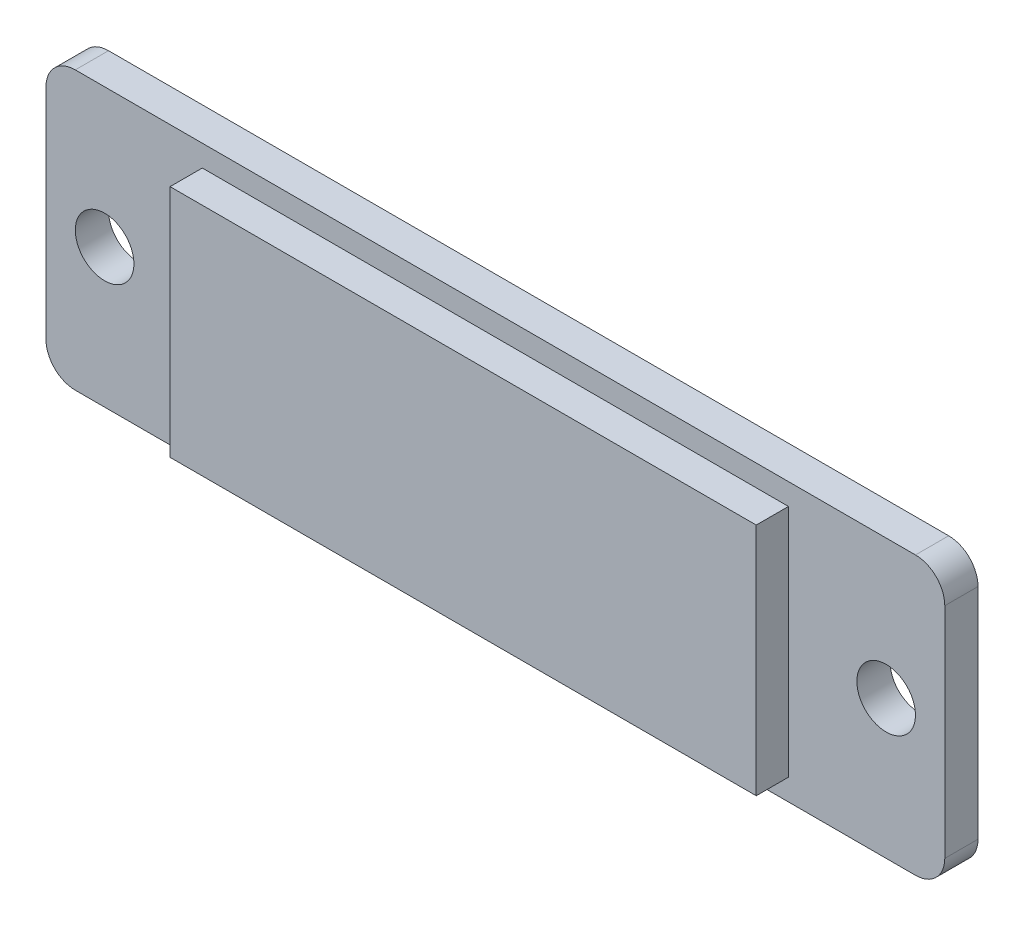
ISO-10303-21;
HEADER;
FILE_DESCRIPTION(('STEP AP214'),'2;1');
FILE_NAME('part.step','',(''),(''),'','','');
FILE_SCHEMA(('AUTOMOTIVE_DESIGN { 1 0 10303 214 1 1 1 1 }'));
ENDSEC;
DATA;
#1=APPLICATION_CONTEXT('core data for automotive mechanical design processes');
#2=APPLICATION_PROTOCOL_DEFINITION('international standard','automotive_design',2000,#1);
#3=PRODUCT_CONTEXT('',#1,'mechanical');
#4=PRODUCT('Part','Part','',(#3));
#5=PRODUCT_RELATED_PRODUCT_CATEGORY('part','',(#4));
#6=PRODUCT_DEFINITION_FORMATION('','',#4);
#7=PRODUCT_DEFINITION_CONTEXT('part definition',#1,'design');
#8=PRODUCT_DEFINITION('design','',#6,#7);
#9=PRODUCT_DEFINITION_SHAPE('','',#8);
#10=(LENGTH_UNIT() NAMED_UNIT(*) SI_UNIT(.MILLI.,.METRE.));
#11=(NAMED_UNIT(*) PLANE_ANGLE_UNIT() SI_UNIT($,.RADIAN.));
#12=(NAMED_UNIT(*) SI_UNIT($,.STERADIAN.) SOLID_ANGLE_UNIT());
#13=UNCERTAINTY_MEASURE_WITH_UNIT(LENGTH_MEASURE(1.E-05),#10,'distance_accuracy_value','');
#14=(GEOMETRIC_REPRESENTATION_CONTEXT(3) GLOBAL_UNCERTAINTY_ASSIGNED_CONTEXT((#13)) GLOBAL_UNIT_ASSIGNED_CONTEXT((#10,
#11,#12)) REPRESENTATION_CONTEXT('',''));
#15=CARTESIAN_POINT('',(0.,0.,0.));
#16=DIRECTION('',(0.,0.,1.));
#17=DIRECTION('',(1.,0.,0.));
#18=AXIS2_PLACEMENT_3D('',#15,#16,#17);
#19=CARTESIAN_POINT('',(-0.47863691545337,0.573934953021328,0.));
#20=DIRECTION('',(0.,0.,-1.));
#21=DIRECTION('',(0.,-1.,0.));
#22=AXIS2_PLACEMENT_3D('',#19,#20,#21);
#23=PLANE('',#22);
#24=CARTESIAN_POINT('',(-20.4786369154534,0.573934953021329,0.));
#25=DIRECTION('',(0.,0.,1.));
#26=DIRECTION('',(1.,0.,0.));
#27=AXIS2_PLACEMENT_3D('',#24,#25,#26);
#28=CIRCLE('',#27,1.5);
#29=CARTESIAN_POINT('',(-21.9786369154534,0.573934953021329,0.));
#30=VERTEX_POINT('',#29);
#31=EDGE_CURVE('E262',#30,#30,#28,.T.);
#32=ORIENTED_EDGE('',*,*,#31,.F.);
#33=EDGE_LOOP('',(#32));
#34=FACE_BOUND('',#33,.T.);
#35=CARTESIAN_POINT('',(19.5213630845466,0.573934953021329,0.));
#36=DIRECTION('',(0.,0.,1.));
#37=DIRECTION('',(1.,0.,0.));
#38=AXIS2_PLACEMENT_3D('',#35,#36,#37);
#39=CIRCLE('',#38,1.5);
#40=CARTESIAN_POINT('',(18.0213630845466,0.573934953021329,0.));
#41=VERTEX_POINT('',#40);
#42=EDGE_CURVE('E243',#41,#41,#39,.T.);
#43=ORIENTED_EDGE('',*,*,#42,.F.);
#44=EDGE_LOOP('',(#43));
#45=FACE_BOUND('',#44,.T.);
#46=DIRECTION('',(1.,0.,0.));
#47=VECTOR('',#46,1.);
#48=CARTESIAN_POINT('',(7.0213630845468,6.57393495302133,0.));
#49=LINE('',#48,#47);
#50=CARTESIAN_POINT('',(-15.4786369154534,6.57393495302133,0.));
#51=VERTEX_POINT('',#50);
#52=CARTESIAN_POINT('',(14.521363084547,6.57393495302133,0.));
#53=VERTEX_POINT('',#52);
#54=EDGE_CURVE('E162',#51,#53,#49,.T.);
#55=ORIENTED_EDGE('',*,*,#54,.T.);
#56=DIRECTION('',(0.,-1.,0.));
#57=VECTOR('',#56,1.);
#58=CARTESIAN_POINT('',(14.521363084547,-2.42606504697867,0.));
#59=LINE('',#58,#57);
#60=CARTESIAN_POINT('',(14.521363084547,-5.42606504697867,0.));
#61=VERTEX_POINT('',#60);
#62=EDGE_CURVE('E218',#53,#61,#59,.T.);
#63=ORIENTED_EDGE('',*,*,#62,.T.);
#64=DIRECTION('',(-1.,0.,0.));
#65=VECTOR('',#64,1.);
#66=CARTESIAN_POINT('',(-7.97863691545337,-5.42606504697867,0.));
#67=LINE('',#66,#65);
#68=CARTESIAN_POINT('',(-15.4786369154534,-5.42606504697867,0.));
#69=VERTEX_POINT('',#68);
#70=EDGE_CURVE('E67',#61,#69,#67,.T.);
#71=ORIENTED_EDGE('',*,*,#70,.T.);
#72=DIRECTION('',(0.,1.,0.));
#73=VECTOR('',#72,1.);
#74=CARTESIAN_POINT('',(-15.4786369154534,3.57393495302133,0.));
#75=LINE('',#74,#73);
#76=EDGE_CURVE('E151',#69,#51,#75,.T.);
#77=ORIENTED_EDGE('',*,*,#76,.T.);
#78=EDGE_LOOP('',(#55,#63,#71,#77));
#79=FACE_BOUND('',#78,.T.);
#80=DIRECTION('',(0.,-1.,0.));
#81=VECTOR('',#80,1.);
#82=CARTESIAN_POINT('',(22.5213630845466,0.573934953021329,0.));
#83=LINE('',#82,#81);
#84=CARTESIAN_POINT('',(22.5213630845466,6.17393495302133,0.));
#85=VERTEX_POINT('',#84);
#86=CARTESIAN_POINT('',(22.5213630845466,-5.02606504697867,0.));
#87=VERTEX_POINT('',#86);
#88=EDGE_CURVE('E27',#85,#87,#83,.T.);
#89=ORIENTED_EDGE('',*,*,#88,.F.);
#90=CARTESIAN_POINT('',(21.0213630845466,6.17393495302133,0.));
#91=DIRECTION('',(0.,0.,-1.));
#92=DIRECTION('',(0.,1.,0.));
#93=AXIS2_PLACEMENT_3D('',#90,#91,#92);
#94=CIRCLE('',#93,1.5);
#95=CARTESIAN_POINT('',(21.0213630845466,7.67393495302133,0.));
#96=VERTEX_POINT('',#95);
#97=EDGE_CURVE('E245',#96,#85,#94,.T.);
#98=ORIENTED_EDGE('',*,*,#97,.F.);
#99=DIRECTION('',(1.,0.,0.));
#100=VECTOR('',#99,1.);
#101=CARTESIAN_POINT('',(-21.9786369154534,7.67393495302133,0.));
#102=LINE('',#101,#100);
#103=CARTESIAN_POINT('',(-21.9786369154534,7.67393495302133,0.));
#104=VERTEX_POINT('',#103);
#105=EDGE_CURVE('E201',#104,#96,#102,.T.);
#106=ORIENTED_EDGE('',*,*,#105,.F.);
#107=CARTESIAN_POINT('',(-21.9786369154534,6.17393495302133,0.));
#108=DIRECTION('',(0.,0.,-1.));
#109=DIRECTION('',(-1.,0.,0.));
#110=AXIS2_PLACEMENT_3D('',#107,#108,#109);
#111=CIRCLE('',#110,1.5);
#112=CARTESIAN_POINT('',(-23.4786369154534,6.17393495302133,0.));
#113=VERTEX_POINT('',#112);
#114=EDGE_CURVE('E199',#113,#104,#111,.T.);
#115=ORIENTED_EDGE('',*,*,#114,.F.);
#116=DIRECTION('',(0.,-1.,0.));
#117=VECTOR('',#116,1.);
#118=CARTESIAN_POINT('',(-23.4786369154534,0.573934953021329,0.));
#119=LINE('',#118,#117);
#120=CARTESIAN_POINT('',(-23.4786369154534,-5.02606504697867,0.));
#121=VERTEX_POINT('',#120);
#122=EDGE_CURVE('E193',#113,#121,#119,.T.);
#123=ORIENTED_EDGE('',*,*,#122,.T.);
#124=CARTESIAN_POINT('',(-21.9786369154534,-5.02606504697867,0.));
#125=DIRECTION('',(0.,0.,-1.));
#126=DIRECTION('',(0.,-1.,0.));
#127=AXIS2_PLACEMENT_3D('',#124,#125,#126);
#128=CIRCLE('',#127,1.5);
#129=CARTESIAN_POINT('',(-21.9786369154534,-6.52606504697867,0.));
#130=VERTEX_POINT('',#129);
#131=EDGE_CURVE('E235',#130,#121,#128,.T.);
#132=ORIENTED_EDGE('',*,*,#131,.F.);
#133=DIRECTION('',(1.,0.,0.));
#134=VECTOR('',#133,1.);
#135=CARTESIAN_POINT('',(-21.9786369154534,-6.52606504697867,0.));
#136=LINE('',#135,#134);
#137=CARTESIAN_POINT('',(21.0213630845466,-6.52606504697867,0.));
#138=VERTEX_POINT('',#137);
#139=EDGE_CURVE('E219',#130,#138,#136,.T.);
#140=ORIENTED_EDGE('',*,*,#139,.T.);
#141=CARTESIAN_POINT('',(21.0213630845466,-5.02606504697867,0.));
#142=DIRECTION('',(0.,0.,-1.));
#143=DIRECTION('',(1.,0.,0.));
#144=AXIS2_PLACEMENT_3D('',#141,#142,#143);
#145=CIRCLE('',#144,1.5);
#146=EDGE_CURVE('E290',#87,#138,#145,.T.);
#147=ORIENTED_EDGE('',*,*,#146,.F.);
#148=EDGE_LOOP('',(#89,#98,#106,#115,#123,#132,#140,#147));
#149=FACE_BOUND('',#148,.T.);
#150=ADVANCED_FACE('F17',(#34,#45,#79,#149),#23,.F.);
#151=CARTESIAN_POINT('',(-0.47863691545337,0.573934953021328,-1.7));
#152=DIRECTION('',(0.,0.,-1.));
#153=DIRECTION('',(0.,-1.,0.));
#154=AXIS2_PLACEMENT_3D('',#151,#152,#153);
#155=PLANE('',#154);
#156=CARTESIAN_POINT('',(-20.4786369154534,0.573934953021329,-1.7));
#157=DIRECTION('',(0.,0.,1.));
#158=DIRECTION('',(1.,0.,0.));
#159=AXIS2_PLACEMENT_3D('',#156,#157,#158);
#160=CIRCLE('',#159,1.5);
#161=CARTESIAN_POINT('',(-21.9786369154534,0.573934953021329,-1.7));
#162=VERTEX_POINT('',#161);
#163=EDGE_CURVE('E214',#162,#162,#160,.T.);
#164=ORIENTED_EDGE('',*,*,#163,.T.);
#165=EDGE_LOOP('',(#164));
#166=FACE_BOUND('',#165,.T.);
#167=CARTESIAN_POINT('',(19.5213630845466,0.573934953021329,-1.7));
#168=DIRECTION('',(0.,0.,1.));
#169=DIRECTION('',(1.,0.,0.));
#170=AXIS2_PLACEMENT_3D('',#167,#168,#169);
#171=CIRCLE('',#170,1.5);
#172=CARTESIAN_POINT('',(18.0213630845466,0.573934953021329,-1.7));
#173=VERTEX_POINT('',#172);
#174=EDGE_CURVE('E264',#173,#173,#171,.T.);
#175=ORIENTED_EDGE('',*,*,#174,.T.);
#176=EDGE_LOOP('',(#175));
#177=FACE_BOUND('',#176,.T.);
#178=DIRECTION('',(0.,-1.,0.));
#179=VECTOR('',#178,1.);
#180=CARTESIAN_POINT('',(22.5213630845466,0.573934953021329,-1.7));
#181=LINE('',#180,#179);
#182=CARTESIAN_POINT('',(22.5213630845466,6.17393495302133,-1.7));
#183=VERTEX_POINT('',#182);
#184=CARTESIAN_POINT('',(22.5213630845466,-5.02606504697867,-1.7));
#185=VERTEX_POINT('',#184);
#186=EDGE_CURVE('E11',#183,#185,#181,.T.);
#187=ORIENTED_EDGE('',*,*,#186,.T.);
#188=CARTESIAN_POINT('',(21.0213630845466,-5.02606504697867,-1.7));
#189=DIRECTION('',(0.,0.,-1.));
#190=DIRECTION('',(1.,0.,0.));
#191=AXIS2_PLACEMENT_3D('',#188,#189,#190);
#192=CIRCLE('',#191,1.5);
#193=CARTESIAN_POINT('',(21.0213630845466,-6.52606504697867,-1.7));
#194=VERTEX_POINT('',#193);
#195=EDGE_CURVE('E211',#185,#194,#192,.T.);
#196=ORIENTED_EDGE('',*,*,#195,.T.);
#197=DIRECTION('',(-1.,0.,0.));
#198=VECTOR('',#197,1.);
#199=CARTESIAN_POINT('',(-21.9786369154534,-6.52606504697867,-1.7));
#200=LINE('',#199,#198);
#201=CARTESIAN_POINT('',(-21.9786369154534,-6.52606504697867,-1.7));
#202=VERTEX_POINT('',#201);
#203=EDGE_CURVE('E223',#194,#202,#200,.T.);
#204=ORIENTED_EDGE('',*,*,#203,.T.);
#205=CARTESIAN_POINT('',(-21.9786369154534,-5.02606504697867,-1.7));
#206=DIRECTION('',(0.,0.,-1.));
#207=DIRECTION('',(0.,-1.,0.));
#208=AXIS2_PLACEMENT_3D('',#205,#206,#207);
#209=CIRCLE('',#208,1.5);
#210=CARTESIAN_POINT('',(-23.4786369154534,-5.02606504697867,-1.7));
#211=VERTEX_POINT('',#210);
#212=EDGE_CURVE('E239',#202,#211,#209,.T.);
#213=ORIENTED_EDGE('',*,*,#212,.T.);
#214=DIRECTION('',(0.,1.,0.));
#215=VECTOR('',#214,1.);
#216=CARTESIAN_POINT('',(-23.4786369154534,0.573934953021329,-1.7));
#217=LINE('',#216,#215);
#218=CARTESIAN_POINT('',(-23.4786369154534,6.17393495302133,-1.7));
#219=VERTEX_POINT('',#218);
#220=EDGE_CURVE('E228',#211,#219,#217,.T.);
#221=ORIENTED_EDGE('',*,*,#220,.T.);
#222=CARTESIAN_POINT('',(-21.9786369154534,6.17393495302133,-1.7));
#223=DIRECTION('',(0.,0.,-1.));
#224=DIRECTION('',(-1.,0.,0.));
#225=AXIS2_PLACEMENT_3D('',#222,#223,#224);
#226=CIRCLE('',#225,1.5);
#227=CARTESIAN_POINT('',(-21.9786369154534,7.67393495302133,-1.7));
#228=VERTEX_POINT('',#227);
#229=EDGE_CURVE('E194',#219,#228,#226,.T.);
#230=ORIENTED_EDGE('',*,*,#229,.T.);
#231=DIRECTION('',(1.,0.,0.));
#232=VECTOR('',#231,1.);
#233=CARTESIAN_POINT('',(-21.9786369154534,7.67393495302133,-1.7));
#234=LINE('',#233,#232);
#235=CARTESIAN_POINT('',(21.0213630845466,7.67393495302133,-1.7));
#236=VERTEX_POINT('',#235);
#237=EDGE_CURVE('E200',#228,#236,#234,.T.);
#238=ORIENTED_EDGE('',*,*,#237,.T.);
#239=CARTESIAN_POINT('',(21.0213630845466,6.17393495302133,-1.7));
#240=DIRECTION('',(0.,0.,-1.));
#241=DIRECTION('',(0.,1.,0.));
#242=AXIS2_PLACEMENT_3D('',#239,#240,#241);
#243=CIRCLE('',#242,1.5);
#244=EDGE_CURVE('E231',#236,#183,#243,.T.);
#245=ORIENTED_EDGE('',*,*,#244,.T.);
#246=EDGE_LOOP('',(#187,#196,#204,#213,#221,#230,#238,#245));
#247=FACE_BOUND('',#246,.T.);
#248=ADVANCED_FACE('F298',(#166,#177,#247),#155,.T.);
#249=CARTESIAN_POINT('',(22.5213630845466,6.17393495302133,0.));
#250=DIRECTION('',(1.,0.,0.));
#251=DIRECTION('',(0.,1.,0.));
#252=AXIS2_PLACEMENT_3D('',#249,#250,#251);
#253=PLANE('',#252);
#254=ORIENTED_EDGE('',*,*,#88,.T.);
#255=DIRECTION('',(0.,0.,-1.));
#256=VECTOR('',#255,1.);
#257=CARTESIAN_POINT('',(22.5213630845466,-5.02606504697867,0.));
#258=LINE('',#257,#256);
#259=EDGE_CURVE('E188',#87,#185,#258,.T.);
#260=ORIENTED_EDGE('',*,*,#259,.T.);
#261=ORIENTED_EDGE('',*,*,#186,.F.);
#262=DIRECTION('',(0.,0.,-1.));
#263=VECTOR('',#262,1.);
#264=CARTESIAN_POINT('',(22.5213630845466,6.17393495302133,0.));
#265=LINE('',#264,#263);
#266=EDGE_CURVE('E234',#85,#183,#265,.T.);
#267=ORIENTED_EDGE('',*,*,#266,.F.);
#268=EDGE_LOOP('',(#254,#260,#261,#267));
#269=FACE_BOUND('',#268,.T.);
#270=ADVANCED_FACE('F478',(#269),#253,.T.);
#271=CARTESIAN_POINT('',(21.0213630845466,-5.02606504697867,0.));
#272=DIRECTION('',(0.,0.,-1.));
#273=DIRECTION('',(1.,0.,0.));
#274=AXIS2_PLACEMENT_3D('',#271,#272,#273);
#275=CYLINDRICAL_SURFACE('',#274,1.5);
#276=ORIENTED_EDGE('',*,*,#146,.T.);
#277=DIRECTION('',(0.,0.,-1.));
#278=VECTOR('',#277,1.);
#279=CARTESIAN_POINT('',(21.0213630845466,-6.52606504697867,0.));
#280=LINE('',#279,#278);
#281=EDGE_CURVE('E292',#138,#194,#280,.T.);
#282=ORIENTED_EDGE('',*,*,#281,.T.);
#283=ORIENTED_EDGE('',*,*,#195,.F.);
#284=ORIENTED_EDGE('',*,*,#259,.F.);
#285=EDGE_LOOP('',(#276,#282,#283,#284));
#286=FACE_BOUND('',#285,.T.);
#287=ADVANCED_FACE('F304',(#286),#275,.T.);
#288=CARTESIAN_POINT('',(21.0213630845466,-6.52606504697867,0.));
#289=DIRECTION('',(0.,-1.,0.));
#290=DIRECTION('',(0.,0.,-1.));
#291=AXIS2_PLACEMENT_3D('',#288,#289,#290);
#292=PLANE('',#291);
#293=ORIENTED_EDGE('',*,*,#139,.F.);
#294=DIRECTION('',(0.,0.,-1.));
#295=VECTOR('',#294,1.);
#296=CARTESIAN_POINT('',(-21.9786369154534,-6.52606504697867,0.));
#297=LINE('',#296,#295);
#298=EDGE_CURVE('E224',#130,#202,#297,.T.);
#299=ORIENTED_EDGE('',*,*,#298,.T.);
#300=ORIENTED_EDGE('',*,*,#203,.F.);
#301=ORIENTED_EDGE('',*,*,#281,.F.);
#302=EDGE_LOOP('',(#293,#299,#300,#301));
#303=FACE_BOUND('',#302,.T.);
#304=ADVANCED_FACE('F310',(#303),#292,.T.);
#305=CARTESIAN_POINT('',(-21.9786369154534,-5.02606504697867,0.));
#306=DIRECTION('',(0.,0.,-1.));
#307=DIRECTION('',(0.,-1.,0.));
#308=AXIS2_PLACEMENT_3D('',#305,#306,#307);
#309=CYLINDRICAL_SURFACE('',#308,1.5);
#310=ORIENTED_EDGE('',*,*,#131,.T.);
#311=DIRECTION('',(0.,0.,-1.));
#312=VECTOR('',#311,1.);
#313=CARTESIAN_POINT('',(-23.4786369154534,-5.02606504697867,0.));
#314=LINE('',#313,#312);
#315=EDGE_CURVE('E240',#121,#211,#314,.T.);
#316=ORIENTED_EDGE('',*,*,#315,.T.);
#317=ORIENTED_EDGE('',*,*,#212,.F.);
#318=ORIENTED_EDGE('',*,*,#298,.F.);
#319=EDGE_LOOP('',(#310,#316,#317,#318));
#320=FACE_BOUND('',#319,.T.);
#321=ADVANCED_FACE('F500',(#320),#309,.T.);
#322=CARTESIAN_POINT('',(-23.4786369154534,-5.02606504697867,0.));
#323=DIRECTION('',(-1.,0.,0.));
#324=DIRECTION('',(0.,0.,1.));
#325=AXIS2_PLACEMENT_3D('',#322,#323,#324);
#326=PLANE('',#325);
#327=ORIENTED_EDGE('',*,*,#122,.F.);
#328=DIRECTION('',(0.,0.,-1.));
#329=VECTOR('',#328,1.);
#330=CARTESIAN_POINT('',(-23.4786369154534,6.17393495302133,0.));
#331=LINE('',#330,#329);
#332=EDGE_CURVE('E189',#113,#219,#331,.T.);
#333=ORIENTED_EDGE('',*,*,#332,.T.);
#334=ORIENTED_EDGE('',*,*,#220,.F.);
#335=ORIENTED_EDGE('',*,*,#315,.F.);
#336=EDGE_LOOP('',(#327,#333,#334,#335));
#337=FACE_BOUND('',#336,.T.);
#338=ADVANCED_FACE('F532',(#337),#326,.T.);
#339=CARTESIAN_POINT('',(-21.9786369154534,6.17393495302133,0.));
#340=DIRECTION('',(0.,0.,-1.));
#341=DIRECTION('',(-1.,0.,0.));
#342=AXIS2_PLACEMENT_3D('',#339,#340,#341);
#343=CYLINDRICAL_SURFACE('',#342,1.5);
#344=ORIENTED_EDGE('',*,*,#114,.T.);
#345=DIRECTION('',(0.,0.,-1.));
#346=VECTOR('',#345,1.);
#347=CARTESIAN_POINT('',(-21.9786369154534,7.67393495302133,0.));
#348=LINE('',#347,#346);
#349=EDGE_CURVE('E195',#104,#228,#348,.T.);
#350=ORIENTED_EDGE('',*,*,#349,.T.);
#351=ORIENTED_EDGE('',*,*,#229,.F.);
#352=ORIENTED_EDGE('',*,*,#332,.F.);
#353=EDGE_LOOP('',(#344,#350,#351,#352));
#354=FACE_BOUND('',#353,.T.);
#355=ADVANCED_FACE('F537',(#354),#343,.T.);
#356=CARTESIAN_POINT('',(-21.9786369154534,7.67393495302133,0.));
#357=DIRECTION('',(0.,1.,0.));
#358=DIRECTION('',(1.,0.,0.));
#359=AXIS2_PLACEMENT_3D('',#356,#357,#358);
#360=PLANE('',#359);
#361=ORIENTED_EDGE('',*,*,#105,.T.);
#362=DIRECTION('',(0.,0.,-1.));
#363=VECTOR('',#362,1.);
#364=CARTESIAN_POINT('',(21.0213630845466,7.67393495302133,0.));
#365=LINE('',#364,#363);
#366=EDGE_CURVE('E184',#96,#236,#365,.T.);
#367=ORIENTED_EDGE('',*,*,#366,.T.);
#368=ORIENTED_EDGE('',*,*,#237,.F.);
#369=ORIENTED_EDGE('',*,*,#349,.F.);
#370=EDGE_LOOP('',(#361,#367,#368,#369));
#371=FACE_BOUND('',#370,.T.);
#372=ADVANCED_FACE('F490',(#371),#360,.T.);
#373=CARTESIAN_POINT('',(21.0213630845466,6.17393495302133,0.));
#374=DIRECTION('',(0.,0.,-1.));
#375=DIRECTION('',(0.,1.,0.));
#376=AXIS2_PLACEMENT_3D('',#373,#374,#375);
#377=CYLINDRICAL_SURFACE('',#376,1.5);
#378=ORIENTED_EDGE('',*,*,#97,.T.);
#379=ORIENTED_EDGE('',*,*,#266,.T.);
#380=ORIENTED_EDGE('',*,*,#244,.F.);
#381=ORIENTED_EDGE('',*,*,#366,.F.);
#382=EDGE_LOOP('',(#378,#379,#380,#381));
#383=FACE_BOUND('',#382,.T.);
#384=ADVANCED_FACE('F484',(#383),#377,.T.);
#385=CARTESIAN_POINT('',(19.5213630845466,0.573934953021329,0.));
#386=DIRECTION('',(0.,0.,-1.));
#387=DIRECTION('',(1.,0.,0.));
#388=AXIS2_PLACEMENT_3D('',#385,#386,#387);
#389=CYLINDRICAL_SURFACE('',#388,1.5);
#390=ORIENTED_EDGE('',*,*,#174,.F.);
#391=DIRECTION('',(0.,0.,1.));
#392=VECTOR('',#391,1.);
#393=CARTESIAN_POINT('',(18.0213630845466,0.573934953021329,0.));
#394=LINE('',#393,#392);
#395=EDGE_CURVE('E246',#173,#41,#394,.T.);
#396=ORIENTED_EDGE('',*,*,#395,.T.);
#397=ORIENTED_EDGE('',*,*,#42,.T.);
#398=ORIENTED_EDGE('',*,*,#395,.F.);
#399=EDGE_LOOP('',(#390,#396,#397,#398));
#400=FACE_BOUND('',#399,.T.);
#401=ADVANCED_FACE('F489',(#400),#389,.F.);
#402=CARTESIAN_POINT('',(-20.4786369154534,0.573934953021329,0.));
#403=DIRECTION('',(0.,0.,-1.));
#404=DIRECTION('',(1.,0.,0.));
#405=AXIS2_PLACEMENT_3D('',#402,#403,#404);
#406=CYLINDRICAL_SURFACE('',#405,1.5);
#407=ORIENTED_EDGE('',*,*,#163,.F.);
#408=DIRECTION('',(0.,0.,1.));
#409=VECTOR('',#408,1.);
#410=CARTESIAN_POINT('',(-21.9786369154534,0.573934953021329,0.));
#411=LINE('',#410,#409);
#412=EDGE_CURVE('E265',#162,#30,#411,.T.);
#413=ORIENTED_EDGE('',*,*,#412,.T.);
#414=ORIENTED_EDGE('',*,*,#31,.T.);
#415=ORIENTED_EDGE('',*,*,#412,.F.);
#416=EDGE_LOOP('',(#407,#413,#414,#415));
#417=FACE_BOUND('',#416,.T.);
#418=ADVANCED_FACE('F19',(#417),#406,.F.);
#419=CARTESIAN_POINT('',(-0.478636915453197,0.573934953021329,1.65));
#420=DIRECTION('',(0.,0.,1.));
#421=DIRECTION('',(1.,0.,0.));
#422=AXIS2_PLACEMENT_3D('',#419,#420,#421);
#423=PLANE('',#422);
#424=DIRECTION('',(0.,-1.,0.));
#425=VECTOR('',#424,1.);
#426=CARTESIAN_POINT('',(-15.4786369154534,0.573934953021329,1.65));
#427=LINE('',#426,#425);
#428=CARTESIAN_POINT('',(-15.4786369154534,6.57393495302133,1.65));
#429=VERTEX_POINT('',#428);
#430=CARTESIAN_POINT('',(-15.4786369154534,-5.42606504697867,1.65));
#431=VERTEX_POINT('',#430);
#432=EDGE_CURVE('E140',#429,#431,#427,.T.);
#433=ORIENTED_EDGE('',*,*,#432,.T.);
#434=DIRECTION('',(1.,0.,0.));
#435=VECTOR('',#434,1.);
#436=CARTESIAN_POINT('',(-15.4786369154534,-5.42606504697867,1.65));
#437=LINE('',#436,#435);
#438=CARTESIAN_POINT('',(14.521363084547,-5.42606504697867,1.65));
#439=VERTEX_POINT('',#438);
#440=EDGE_CURVE('E208',#431,#439,#437,.T.);
#441=ORIENTED_EDGE('',*,*,#440,.T.);
#442=DIRECTION('',(0.,1.,0.));
#443=VECTOR('',#442,1.);
#444=CARTESIAN_POINT('',(14.521363084547,0.573934953021329,1.65));
#445=LINE('',#444,#443);
#446=CARTESIAN_POINT('',(14.521363084547,6.57393495302133,1.65));
#447=VERTEX_POINT('',#446);
#448=EDGE_CURVE('E83',#439,#447,#445,.T.);
#449=ORIENTED_EDGE('',*,*,#448,.T.);
#450=DIRECTION('',(-1.,0.,0.));
#451=VECTOR('',#450,1.);
#452=CARTESIAN_POINT('',(-15.4786369154534,6.57393495302133,1.65));
#453=LINE('',#452,#451);
#454=EDGE_CURVE('E172',#447,#429,#453,.T.);
#455=ORIENTED_EDGE('',*,*,#454,.T.);
#456=EDGE_LOOP('',(#433,#441,#449,#455));
#457=FACE_BOUND('',#456,.T.);
#458=ADVANCED_FACE('F505',(#457),#423,.T.);
#459=CARTESIAN_POINT('',(-15.4786369154534,6.57393495302133,0.));
#460=DIRECTION('',(-1.,0.,0.));
#461=DIRECTION('',(0.,0.,1.));
#462=AXIS2_PLACEMENT_3D('',#459,#460,#461);
#463=PLANE('',#462);
#464=ORIENTED_EDGE('',*,*,#76,.F.);
#465=DIRECTION('',(0.,0.,1.));
#466=VECTOR('',#465,1.);
#467=CARTESIAN_POINT('',(-15.4786369154534,-5.42606504697867,0.));
#468=LINE('',#467,#466);
#469=EDGE_CURVE('E164',#69,#431,#468,.T.);
#470=ORIENTED_EDGE('',*,*,#469,.T.);
#471=ORIENTED_EDGE('',*,*,#432,.F.);
#472=DIRECTION('',(0.,0.,1.));
#473=VECTOR('',#472,1.);
#474=CARTESIAN_POINT('',(-15.4786369154534,6.57393495302133,0.));
#475=LINE('',#474,#473);
#476=EDGE_CURVE('E167',#51,#429,#475,.T.);
#477=ORIENTED_EDGE('',*,*,#476,.F.);
#478=EDGE_LOOP('',(#464,#470,#471,#477));
#479=FACE_BOUND('',#478,.T.);
#480=ADVANCED_FACE('F168',(#479),#463,.T.);
#481=CARTESIAN_POINT('',(-15.4786369154534,-5.42606504697867,0.));
#482=DIRECTION('',(0.,-1.,0.));
#483=DIRECTION('',(0.,0.,-1.));
#484=AXIS2_PLACEMENT_3D('',#481,#482,#483);
#485=PLANE('',#484);
#486=ORIENTED_EDGE('',*,*,#70,.F.);
#487=DIRECTION('',(0.,0.,1.));
#488=VECTOR('',#487,1.);
#489=CARTESIAN_POINT('',(14.521363084547,-5.42606504697867,0.));
#490=LINE('',#489,#488);
#491=EDGE_CURVE('E217',#61,#439,#490,.T.);
#492=ORIENTED_EDGE('',*,*,#491,.T.);
#493=ORIENTED_EDGE('',*,*,#440,.F.);
#494=ORIENTED_EDGE('',*,*,#469,.F.);
#495=EDGE_LOOP('',(#486,#492,#493,#494));
#496=FACE_BOUND('',#495,.T.);
#497=ADVANCED_FACE('F442',(#496),#485,.T.);
#498=CARTESIAN_POINT('',(14.521363084547,-5.42606504697867,0.));
#499=DIRECTION('',(1.,0.,0.));
#500=DIRECTION('',(0.,1.,0.));
#501=AXIS2_PLACEMENT_3D('',#498,#499,#500);
#502=PLANE('',#501);
#503=ORIENTED_EDGE('',*,*,#62,.F.);
#504=DIRECTION('',(0.,0.,1.));
#505=VECTOR('',#504,1.);
#506=CARTESIAN_POINT('',(14.521363084547,6.57393495302133,0.));
#507=LINE('',#506,#505);
#508=EDGE_CURVE('E176',#53,#447,#507,.T.);
#509=ORIENTED_EDGE('',*,*,#508,.T.);
#510=ORIENTED_EDGE('',*,*,#448,.F.);
#511=ORIENTED_EDGE('',*,*,#491,.F.);
#512=EDGE_LOOP('',(#503,#509,#510,#511));
#513=FACE_BOUND('',#512,.T.);
#514=ADVANCED_FACE('F448',(#513),#502,.T.);
#515=CARTESIAN_POINT('',(14.521363084547,6.57393495302133,0.));
#516=DIRECTION('',(0.,1.,0.));
#517=DIRECTION('',(1.,0.,0.));
#518=AXIS2_PLACEMENT_3D('',#515,#516,#517);
#519=PLANE('',#518);
#520=ORIENTED_EDGE('',*,*,#54,.F.);
#521=ORIENTED_EDGE('',*,*,#476,.T.);
#522=ORIENTED_EDGE('',*,*,#454,.F.);
#523=ORIENTED_EDGE('',*,*,#508,.F.);
#524=EDGE_LOOP('',(#520,#521,#522,#523));
#525=FACE_BOUND('',#524,.T.);
#526=ADVANCED_FACE('F175',(#525),#519,.T.);
#527=CLOSED_SHELL('',(#150,#248,#270,#287,#304,#321,#338,#355,#372,#384,#401,#418,#458,#480,
#497,#514,#526));
#528=MANIFOLD_SOLID_BREP('B1',#527);
#529=ADVANCED_BREP_SHAPE_REPRESENTATION('',(#18,#528),#14);
#530=SHAPE_DEFINITION_REPRESENTATION(#9,#529);
ENDSEC;
END-ISO-10303-21;
